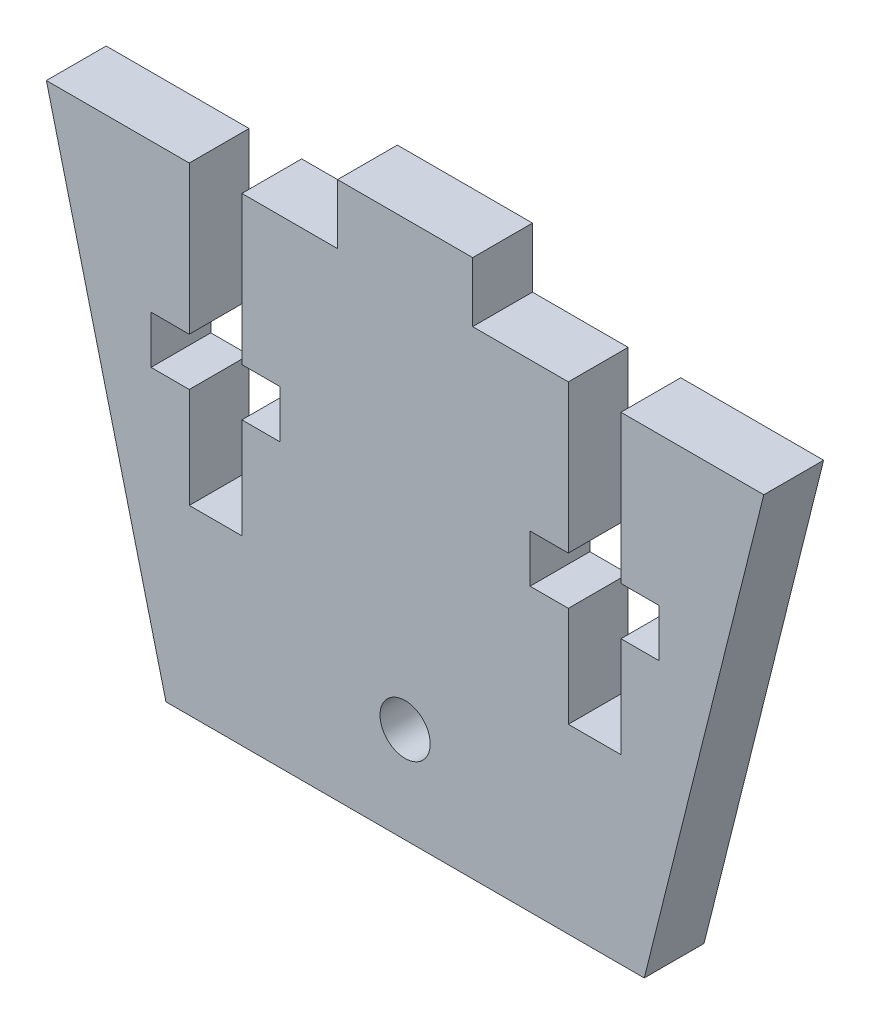
ISO-10303-21;
HEADER;
FILE_DESCRIPTION(('STEP AP214'),'2;1');
FILE_NAME('part.step','',(''),(''),'','','');
FILE_SCHEMA(('AUTOMOTIVE_DESIGN { 1 0 10303 214 1 1 1 1 }'));
ENDSEC;
DATA;
#1=APPLICATION_CONTEXT('core data for automotive mechanical design processes');
#2=APPLICATION_PROTOCOL_DEFINITION('international standard','automotive_design',2000,#1);
#3=PRODUCT_CONTEXT('',#1,'mechanical');
#4=PRODUCT('Part','Part','',(#3));
#5=PRODUCT_RELATED_PRODUCT_CATEGORY('part','',(#4));
#6=PRODUCT_DEFINITION_FORMATION('','',#4);
#7=PRODUCT_DEFINITION_CONTEXT('part definition',#1,'design');
#8=PRODUCT_DEFINITION('design','',#6,#7);
#9=PRODUCT_DEFINITION_SHAPE('','',#8);
#10=(LENGTH_UNIT() NAMED_UNIT(*) SI_UNIT(.MILLI.,.METRE.));
#11=(NAMED_UNIT(*) PLANE_ANGLE_UNIT() SI_UNIT($,.RADIAN.));
#12=(NAMED_UNIT(*) SI_UNIT($,.STERADIAN.) SOLID_ANGLE_UNIT());
#13=UNCERTAINTY_MEASURE_WITH_UNIT(LENGTH_MEASURE(1.E-05),#10,'distance_accuracy_value','');
#14=(GEOMETRIC_REPRESENTATION_CONTEXT(3) GLOBAL_UNCERTAINTY_ASSIGNED_CONTEXT((#13)) GLOBAL_UNIT_ASSIGNED_CONTEXT((#10,
#11,#12)) REPRESENTATION_CONTEXT('',''));
#15=CARTESIAN_POINT('',(0.,0.,0.));
#16=DIRECTION('',(0.,0.,1.));
#17=DIRECTION('',(1.,0.,0.));
#18=AXIS2_PLACEMENT_3D('',#15,#16,#17);
#19=CARTESIAN_POINT('',(0.,28.575,3.175));
#20=DIRECTION('',(0.,1.,0.));
#21=DIRECTION('',(0.,0.,1.));
#22=AXIS2_PLACEMENT_3D('',#19,#20,#21);
#23=PLANE('',#22);
#24=DIRECTION('',(1.,0.,0.));
#25=VECTOR('',#24,1.);
#26=CARTESIAN_POINT('',(0.,28.575,0.));
#27=LINE('',#26,#25);
#28=CARTESIAN_POINT('',(-3.58775,28.575,0.));
#29=VERTEX_POINT('',#28);
#30=CARTESIAN_POINT('',(3.58775,28.575,0.));
#31=VERTEX_POINT('',#30);
#32=EDGE_CURVE('E410',#29,#31,#27,.T.);
#33=ORIENTED_EDGE('',*,*,#32,.F.);
#34=DIRECTION('',(0.,0.,-1.));
#35=VECTOR('',#34,1.);
#36=CARTESIAN_POINT('',(-3.58775,28.575,3.175));
#37=LINE('',#36,#35);
#38=CARTESIAN_POINT('',(-3.58775,28.575,3.175));
#39=VERTEX_POINT('',#38);
#40=EDGE_CURVE('E11',#39,#29,#37,.T.);
#41=ORIENTED_EDGE('',*,*,#40,.F.);
#42=DIRECTION('',(1.,0.,0.));
#43=VECTOR('',#42,1.);
#44=CARTESIAN_POINT('',(0.,28.575,3.175));
#45=LINE('',#44,#43);
#46=CARTESIAN_POINT('',(3.58775,28.575,3.175));
#47=VERTEX_POINT('',#46);
#48=EDGE_CURVE('E325',#39,#47,#45,.T.);
#49=ORIENTED_EDGE('',*,*,#48,.T.);
#50=DIRECTION('',(0.,0.,-1.));
#51=VECTOR('',#50,1.);
#52=CARTESIAN_POINT('',(3.58775,28.575,3.175));
#53=LINE('',#52,#51);
#54=EDGE_CURVE('E161',#47,#31,#53,.T.);
#55=ORIENTED_EDGE('',*,*,#54,.T.);
#56=EDGE_LOOP('',(#33,#41,#49,#55));
#57=FACE_BOUND('',#56,.T.);
#58=ADVANCED_FACE('F39',(#57),#23,.T.);
#59=CARTESIAN_POINT('',(-3.58775,0.,3.175));
#60=DIRECTION('',(-1.,0.,0.));
#61=DIRECTION('',(0.,0.,1.));
#62=AXIS2_PLACEMENT_3D('',#59,#60,#61);
#63=PLANE('',#62);
#64=DIRECTION('',(0.,1.,0.));
#65=VECTOR('',#64,1.);
#66=CARTESIAN_POINT('',(-3.58775,0.,0.));
#67=LINE('',#66,#65);
#68=CARTESIAN_POINT('',(-3.58775,25.4,0.));
#69=VERTEX_POINT('',#68);
#70=EDGE_CURVE('E406',#69,#29,#67,.T.);
#71=ORIENTED_EDGE('',*,*,#70,.F.);
#72=DIRECTION('',(0.,0.,-1.));
#73=VECTOR('',#72,1.);
#74=CARTESIAN_POINT('',(-3.58775,25.4,3.175));
#75=LINE('',#74,#73);
#76=CARTESIAN_POINT('',(-3.58775,25.4,3.175));
#77=VERTEX_POINT('',#76);
#78=EDGE_CURVE('E47',#77,#69,#75,.T.);
#79=ORIENTED_EDGE('',*,*,#78,.F.);
#80=DIRECTION('',(0.,1.,0.));
#81=VECTOR('',#80,1.);
#82=CARTESIAN_POINT('',(-3.58775,0.,3.175));
#83=LINE('',#82,#81);
#84=EDGE_CURVE('E322',#77,#39,#83,.T.);
#85=ORIENTED_EDGE('',*,*,#84,.T.);
#86=ORIENTED_EDGE('',*,*,#40,.T.);
#87=EDGE_LOOP('',(#71,#79,#85,#86));
#88=FACE_BOUND('',#87,.T.);
#89=ADVANCED_FACE('F407',(#88),#63,.T.);
#90=CARTESIAN_POINT('',(0.,25.4,3.175));
#91=DIRECTION('',(0.,1.,0.));
#92=DIRECTION('',(0.,0.,1.));
#93=AXIS2_PLACEMENT_3D('',#90,#91,#92);
#94=PLANE('',#93);
#95=DIRECTION('',(1.,0.,0.));
#96=VECTOR('',#95,1.);
#97=CARTESIAN_POINT('',(0.,25.4,0.));
#98=LINE('',#97,#96);
#99=CARTESIAN_POINT('',(-8.66775,25.4,0.));
#100=VERTEX_POINT('',#99);
#101=EDGE_CURVE('E401',#100,#69,#98,.T.);
#102=ORIENTED_EDGE('',*,*,#101,.F.);
#103=DIRECTION('',(0.,0.,-1.));
#104=VECTOR('',#103,1.);
#105=CARTESIAN_POINT('',(-8.66775,25.4,3.175));
#106=LINE('',#105,#104);
#107=CARTESIAN_POINT('',(-8.66775,25.4,3.175));
#108=VERTEX_POINT('',#107);
#109=EDGE_CURVE('E395',#108,#100,#106,.T.);
#110=ORIENTED_EDGE('',*,*,#109,.F.);
#111=DIRECTION('',(1.,0.,0.));
#112=VECTOR('',#111,1.);
#113=CARTESIAN_POINT('',(0.,25.4,3.175));
#114=LINE('',#113,#112);
#115=EDGE_CURVE('E319',#108,#77,#114,.T.);
#116=ORIENTED_EDGE('',*,*,#115,.T.);
#117=ORIENTED_EDGE('',*,*,#78,.T.);
#118=EDGE_LOOP('',(#102,#110,#116,#117));
#119=FACE_BOUND('',#118,.T.);
#120=ADVANCED_FACE('F399',(#119),#94,.T.);
#121=CARTESIAN_POINT('',(-8.66775,0.,3.175));
#122=DIRECTION('',(1.,0.,0.));
#123=DIRECTION('',(0.,1.,0.));
#124=AXIS2_PLACEMENT_3D('',#121,#122,#123);
#125=PLANE('',#124);
#126=DIRECTION('',(0.,-1.,0.));
#127=VECTOR('',#126,1.);
#128=CARTESIAN_POINT('',(-8.66775,0.,0.));
#129=LINE('',#128,#127);
#130=CARTESIAN_POINT('',(-8.66775,17.526,0.));
#131=VERTEX_POINT('',#130);
#132=EDGE_CURVE('E415',#100,#131,#129,.T.);
#133=ORIENTED_EDGE('',*,*,#132,.T.);
#134=DIRECTION('',(0.,0.,-1.));
#135=VECTOR('',#134,1.);
#136=CARTESIAN_POINT('',(-8.66775,17.526,3.175));
#137=LINE('',#136,#135);
#138=CARTESIAN_POINT('',(-8.66775,17.526,3.175));
#139=VERTEX_POINT('',#138);
#140=EDGE_CURVE('E392',#139,#131,#137,.T.);
#141=ORIENTED_EDGE('',*,*,#140,.F.);
#142=DIRECTION('',(0.,-1.,0.));
#143=VECTOR('',#142,1.);
#144=CARTESIAN_POINT('',(-8.66775,0.,3.175));
#145=LINE('',#144,#143);
#146=EDGE_CURVE('E317',#108,#139,#145,.T.);
#147=ORIENTED_EDGE('',*,*,#146,.F.);
#148=ORIENTED_EDGE('',*,*,#109,.T.);
#149=EDGE_LOOP('',(#133,#141,#147,#148));
#150=FACE_BOUND('',#149,.T.);
#151=ADVANCED_FACE('F587',(#150),#125,.F.);
#152=CARTESIAN_POINT('',(0.,17.526,3.175));
#153=DIRECTION('',(0.,1.,0.));
#154=DIRECTION('',(0.,0.,1.));
#155=AXIS2_PLACEMENT_3D('',#152,#153,#154);
#156=PLANE('',#155);
#157=DIRECTION('',(1.,0.,0.));
#158=VECTOR('',#157,1.);
#159=CARTESIAN_POINT('',(0.,17.526,0.));
#160=LINE('',#159,#158);
#161=CARTESIAN_POINT('',(-6.63575,17.526,0.));
#162=VERTEX_POINT('',#161);
#163=EDGE_CURVE('E417',#131,#162,#160,.T.);
#164=ORIENTED_EDGE('',*,*,#163,.T.);
#165=DIRECTION('',(0.,0.,-1.));
#166=VECTOR('',#165,1.);
#167=CARTESIAN_POINT('',(-6.63575,17.526,3.175));
#168=LINE('',#167,#166);
#169=CARTESIAN_POINT('',(-6.63575,17.526,3.175));
#170=VERTEX_POINT('',#169);
#171=EDGE_CURVE('E389',#170,#162,#168,.T.);
#172=ORIENTED_EDGE('',*,*,#171,.F.);
#173=DIRECTION('',(1.,0.,0.));
#174=VECTOR('',#173,1.);
#175=CARTESIAN_POINT('',(0.,17.526,3.175));
#176=LINE('',#175,#174);
#177=EDGE_CURVE('E315',#139,#170,#176,.T.);
#178=ORIENTED_EDGE('',*,*,#177,.F.);
#179=ORIENTED_EDGE('',*,*,#140,.T.);
#180=EDGE_LOOP('',(#164,#172,#178,#179));
#181=FACE_BOUND('',#180,.T.);
#182=ADVANCED_FACE('F582',(#181),#156,.F.);
#183=CARTESIAN_POINT('',(-6.63574999999997,0.,3.175));
#184=DIRECTION('',(1.,0.,0.));
#185=DIRECTION('',(0.,1.,0.));
#186=AXIS2_PLACEMENT_3D('',#183,#184,#185);
#187=PLANE('',#186);
#188=DIRECTION('',(0.,-1.,0.));
#189=VECTOR('',#188,1.);
#190=CARTESIAN_POINT('',(-6.63574999999997,0.,0.));
#191=LINE('',#190,#189);
#192=CARTESIAN_POINT('',(-6.63575,14.986,0.));
#193=VERTEX_POINT('',#192);
#194=EDGE_CURVE('E423',#162,#193,#191,.T.);
#195=ORIENTED_EDGE('',*,*,#194,.T.);
#196=DIRECTION('',(0.,0.,-1.));
#197=VECTOR('',#196,1.);
#198=CARTESIAN_POINT('',(-6.63575,14.986,3.175));
#199=LINE('',#198,#197);
#200=CARTESIAN_POINT('',(-6.63575,14.986,3.175));
#201=VERTEX_POINT('',#200);
#202=EDGE_CURVE('E386',#201,#193,#199,.T.);
#203=ORIENTED_EDGE('',*,*,#202,.F.);
#204=DIRECTION('',(0.,-1.,0.));
#205=VECTOR('',#204,1.);
#206=CARTESIAN_POINT('',(-6.63574999999997,0.,3.175));
#207=LINE('',#206,#205);
#208=EDGE_CURVE('E313',#170,#201,#207,.T.);
#209=ORIENTED_EDGE('',*,*,#208,.F.);
#210=ORIENTED_EDGE('',*,*,#171,.T.);
#211=EDGE_LOOP('',(#195,#203,#209,#210));
#212=FACE_BOUND('',#211,.T.);
#213=ADVANCED_FACE('F579',(#212),#187,.F.);
#214=CARTESIAN_POINT('',(0.,14.986,3.175));
#215=DIRECTION('',(0.,-1.,0.));
#216=DIRECTION('',(0.,0.,-1.));
#217=AXIS2_PLACEMENT_3D('',#214,#215,#216);
#218=PLANE('',#217);
#219=DIRECTION('',(-1.,0.,0.));
#220=VECTOR('',#219,1.);
#221=CARTESIAN_POINT('',(0.,14.986,0.));
#222=LINE('',#221,#220);
#223=CARTESIAN_POINT('',(-8.66775,14.986,0.));
#224=VERTEX_POINT('',#223);
#225=EDGE_CURVE('E426',#193,#224,#222,.T.);
#226=ORIENTED_EDGE('',*,*,#225,.T.);
#227=DIRECTION('',(0.,0.,-1.));
#228=VECTOR('',#227,1.);
#229=CARTESIAN_POINT('',(-8.66775,14.986,3.175));
#230=LINE('',#229,#228);
#231=CARTESIAN_POINT('',(-8.66775,14.986,3.175));
#232=VERTEX_POINT('',#231);
#233=EDGE_CURVE('E383',#232,#224,#230,.T.);
#234=ORIENTED_EDGE('',*,*,#233,.F.);
#235=DIRECTION('',(-1.,0.,0.));
#236=VECTOR('',#235,1.);
#237=CARTESIAN_POINT('',(0.,14.986,3.175));
#238=LINE('',#237,#236);
#239=EDGE_CURVE('E311',#201,#232,#238,.T.);
#240=ORIENTED_EDGE('',*,*,#239,.F.);
#241=ORIENTED_EDGE('',*,*,#202,.T.);
#242=EDGE_LOOP('',(#226,#234,#240,#241));
#243=FACE_BOUND('',#242,.T.);
#244=ADVANCED_FACE('F575',(#243),#218,.F.);
#245=CARTESIAN_POINT('',(-8.66775,9.65199999999999,0.));
#246=VERTEX_POINT('',#245);
#247=EDGE_CURVE('E419',#224,#246,#129,.T.);
#248=ORIENTED_EDGE('',*,*,#247,.T.);
#249=DIRECTION('',(0.,0.,-1.));
#250=VECTOR('',#249,1.);
#251=CARTESIAN_POINT('',(-8.66775,9.65199999999999,3.175));
#252=LINE('',#251,#250);
#253=CARTESIAN_POINT('',(-8.66775,9.65199999999999,3.175));
#254=VERTEX_POINT('',#253);
#255=EDGE_CURVE('E381',#254,#246,#252,.T.);
#256=ORIENTED_EDGE('',*,*,#255,.F.);
#257=EDGE_CURVE('E310',#232,#254,#145,.T.);
#258=ORIENTED_EDGE('',*,*,#257,.F.);
#259=ORIENTED_EDGE('',*,*,#233,.T.);
#260=EDGE_LOOP('',(#248,#256,#258,#259));
#261=FACE_BOUND('',#260,.T.);
#262=ADVANCED_FACE('F570',(#261),#125,.F.);
#263=CARTESIAN_POINT('',(0.,9.65199999999999,3.175));
#264=DIRECTION('',(0.,1.,0.));
#265=DIRECTION('',(0.,0.,1.));
#266=AXIS2_PLACEMENT_3D('',#263,#264,#265);
#267=PLANE('',#266);
#268=DIRECTION('',(1.,0.,0.));
#269=VECTOR('',#268,1.);
#270=CARTESIAN_POINT('',(0.,9.65199999999999,0.));
#271=LINE('',#270,#269);
#272=CARTESIAN_POINT('',(-11.46175,9.65199999999999,0.));
#273=VERTEX_POINT('',#272);
#274=EDGE_CURVE('E429',#273,#246,#271,.T.);
#275=ORIENTED_EDGE('',*,*,#274,.F.);
#276=DIRECTION('',(0.,0.,-1.));
#277=VECTOR('',#276,1.);
#278=CARTESIAN_POINT('',(-11.46175,9.65199999999999,3.175));
#279=LINE('',#278,#277);
#280=CARTESIAN_POINT('',(-11.46175,9.65199999999999,3.175));
#281=VERTEX_POINT('',#280);
#282=EDGE_CURVE('E379',#281,#273,#279,.T.);
#283=ORIENTED_EDGE('',*,*,#282,.F.);
#284=DIRECTION('',(1.,0.,0.));
#285=VECTOR('',#284,1.);
#286=CARTESIAN_POINT('',(0.,9.65199999999999,3.175));
#287=LINE('',#286,#285);
#288=EDGE_CURVE('E307',#281,#254,#287,.T.);
#289=ORIENTED_EDGE('',*,*,#288,.T.);
#290=ORIENTED_EDGE('',*,*,#255,.T.);
#291=EDGE_LOOP('',(#275,#283,#289,#290));
#292=FACE_BOUND('',#291,.T.);
#293=ADVANCED_FACE('F563',(#292),#267,.T.);
#294=CARTESIAN_POINT('',(-11.46175,0.,3.175));
#295=DIRECTION('',(1.,0.,0.));
#296=DIRECTION('',(0.,1.,0.));
#297=AXIS2_PLACEMENT_3D('',#294,#295,#296);
#298=PLANE('',#297);
#299=DIRECTION('',(0.,-1.,0.));
#300=VECTOR('',#299,1.);
#301=CARTESIAN_POINT('',(-11.46175,0.,0.));
#302=LINE('',#301,#300);
#303=CARTESIAN_POINT('',(-11.46175,14.986,0.));
#304=VERTEX_POINT('',#303);
#305=EDGE_CURVE('E432',#304,#273,#302,.T.);
#306=ORIENTED_EDGE('',*,*,#305,.F.);
#307=DIRECTION('',(0.,0.,-1.));
#308=VECTOR('',#307,1.);
#309=CARTESIAN_POINT('',(-11.46175,14.986,3.175));
#310=LINE('',#309,#308);
#311=CARTESIAN_POINT('',(-11.46175,14.986,3.175));
#312=VERTEX_POINT('',#311);
#313=EDGE_CURVE('E377',#312,#304,#310,.T.);
#314=ORIENTED_EDGE('',*,*,#313,.F.);
#315=DIRECTION('',(0.,-1.,0.));
#316=VECTOR('',#315,1.);
#317=CARTESIAN_POINT('',(-11.46175,0.,3.175));
#318=LINE('',#317,#316);
#319=EDGE_CURVE('E304',#312,#281,#318,.T.);
#320=ORIENTED_EDGE('',*,*,#319,.T.);
#321=ORIENTED_EDGE('',*,*,#282,.T.);
#322=EDGE_LOOP('',(#306,#314,#320,#321));
#323=FACE_BOUND('',#322,.T.);
#324=ADVANCED_FACE('F557',(#323),#298,.T.);
#325=CARTESIAN_POINT('',(-13.49375,14.986,0.));
#326=VERTEX_POINT('',#325);
#327=EDGE_CURVE('E428',#304,#326,#222,.T.);
#328=ORIENTED_EDGE('',*,*,#327,.T.);
#329=DIRECTION('',(0.,0.,-1.));
#330=VECTOR('',#329,1.);
#331=CARTESIAN_POINT('',(-13.49375,14.986,3.175));
#332=LINE('',#331,#330);
#333=CARTESIAN_POINT('',(-13.49375,14.986,3.175));
#334=VERTEX_POINT('',#333);
#335=EDGE_CURVE('E375',#334,#326,#332,.T.);
#336=ORIENTED_EDGE('',*,*,#335,.F.);
#337=EDGE_CURVE('E303',#312,#334,#238,.T.);
#338=ORIENTED_EDGE('',*,*,#337,.F.);
#339=ORIENTED_EDGE('',*,*,#313,.T.);
#340=EDGE_LOOP('',(#328,#336,#338,#339));
#341=FACE_BOUND('',#340,.T.);
#342=ADVANCED_FACE('F588',(#341),#218,.F.);
#343=CARTESIAN_POINT('',(-13.49375,0.,3.175));
#344=DIRECTION('',(1.,0.,0.));
#345=DIRECTION('',(0.,1.,0.));
#346=AXIS2_PLACEMENT_3D('',#343,#344,#345);
#347=PLANE('',#346);
#348=DIRECTION('',(0.,-1.,0.));
#349=VECTOR('',#348,1.);
#350=CARTESIAN_POINT('',(-13.49375,0.,0.));
#351=LINE('',#350,#349);
#352=CARTESIAN_POINT('',(-13.49375,17.526,0.));
#353=VERTEX_POINT('',#352);
#354=EDGE_CURVE('E436',#353,#326,#351,.T.);
#355=ORIENTED_EDGE('',*,*,#354,.F.);
#356=DIRECTION('',(0.,0.,-1.));
#357=VECTOR('',#356,1.);
#358=CARTESIAN_POINT('',(-13.49375,17.526,3.175));
#359=LINE('',#358,#357);
#360=CARTESIAN_POINT('',(-13.49375,17.526,3.175));
#361=VERTEX_POINT('',#360);
#362=EDGE_CURVE('E373',#361,#353,#359,.T.);
#363=ORIENTED_EDGE('',*,*,#362,.F.);
#364=DIRECTION('',(0.,-1.,0.));
#365=VECTOR('',#364,1.);
#366=CARTESIAN_POINT('',(-13.49375,0.,3.175));
#367=LINE('',#366,#365);
#368=EDGE_CURVE('E299',#361,#334,#367,.T.);
#369=ORIENTED_EDGE('',*,*,#368,.T.);
#370=ORIENTED_EDGE('',*,*,#335,.T.);
#371=EDGE_LOOP('',(#355,#363,#369,#370));
#372=FACE_BOUND('',#371,.T.);
#373=ADVANCED_FACE('F550',(#372),#347,.T.);
#374=CARTESIAN_POINT('',(-11.46175,17.526,0.));
#375=VERTEX_POINT('',#374);
#376=EDGE_CURVE('E424',#353,#375,#160,.T.);
#377=ORIENTED_EDGE('',*,*,#376,.T.);
#378=DIRECTION('',(0.,0.,-1.));
#379=VECTOR('',#378,1.);
#380=CARTESIAN_POINT('',(-11.46175,17.526,3.175));
#381=LINE('',#380,#379);
#382=CARTESIAN_POINT('',(-11.46175,17.526,3.175));
#383=VERTEX_POINT('',#382);
#384=EDGE_CURVE('E371',#383,#375,#381,.T.);
#385=ORIENTED_EDGE('',*,*,#384,.F.);
#386=EDGE_CURVE('E302',#361,#383,#176,.T.);
#387=ORIENTED_EDGE('',*,*,#386,.F.);
#388=ORIENTED_EDGE('',*,*,#362,.T.);
#389=EDGE_LOOP('',(#377,#385,#387,#388));
#390=FACE_BOUND('',#389,.T.);
#391=ADVANCED_FACE('F545',(#390),#156,.F.);
#392=CARTESIAN_POINT('',(-11.46175,25.4,0.));
#393=VERTEX_POINT('',#392);
#394=EDGE_CURVE('E435',#393,#375,#302,.T.);
#395=ORIENTED_EDGE('',*,*,#394,.F.);
#396=DIRECTION('',(0.,0.,-1.));
#397=VECTOR('',#396,1.);
#398=CARTESIAN_POINT('',(-11.46175,25.4,3.175));
#399=LINE('',#398,#397);
#400=CARTESIAN_POINT('',(-11.46175,25.4,3.175));
#401=VERTEX_POINT('',#400);
#402=EDGE_CURVE('E369',#401,#393,#399,.T.);
#403=ORIENTED_EDGE('',*,*,#402,.F.);
#404=EDGE_CURVE('E298',#401,#383,#318,.T.);
#405=ORIENTED_EDGE('',*,*,#404,.T.);
#406=ORIENTED_EDGE('',*,*,#384,.T.);
#407=EDGE_LOOP('',(#395,#403,#405,#406));
#408=FACE_BOUND('',#407,.T.);
#409=ADVANCED_FACE('F597',(#408),#298,.T.);
#410=CARTESIAN_POINT('',(0.,25.4,3.175));
#411=DIRECTION('',(0.,1.,0.));
#412=DIRECTION('',(-1.,0.,0.));
#413=AXIS2_PLACEMENT_3D('',#410,#411,#412);
#414=PLANE('',#413);
#415=DIRECTION('',(1.,0.,0.));
#416=VECTOR('',#415,1.);
#417=CARTESIAN_POINT('',(0.,25.4,0.));
#418=LINE('',#417,#416);
#419=CARTESIAN_POINT('',(-19.05,25.4,0.));
#420=VERTEX_POINT('',#419);
#421=EDGE_CURVE('E439',#420,#393,#418,.T.);
#422=ORIENTED_EDGE('',*,*,#421,.F.);
#423=DIRECTION('',(0.,0.,-1.));
#424=VECTOR('',#423,1.);
#425=CARTESIAN_POINT('',(-19.05,25.4,3.175));
#426=LINE('',#425,#424);
#427=CARTESIAN_POINT('',(-19.05,25.4,3.175));
#428=VERTEX_POINT('',#427);
#429=EDGE_CURVE('E367',#428,#420,#426,.T.);
#430=ORIENTED_EDGE('',*,*,#429,.F.);
#431=DIRECTION('',(1.,0.,0.));
#432=VECTOR('',#431,1.);
#433=CARTESIAN_POINT('',(0.,25.4,3.175));
#434=LINE('',#433,#432);
#435=EDGE_CURVE('E295',#428,#401,#434,.T.);
#436=ORIENTED_EDGE('',*,*,#435,.T.);
#437=ORIENTED_EDGE('',*,*,#402,.T.);
#438=EDGE_LOOP('',(#422,#430,#436,#437));
#439=FACE_BOUND('',#438,.T.);
#440=ADVANCED_FACE('F536',(#439),#414,.T.);
#441=CARTESIAN_POINT('',(-11.9529411764706,-2.98823529411765,3.175));
#442=DIRECTION('',(0.970142500145332,0.242535625036333,0.));
#443=DIRECTION('',(-0.242535625036333,0.970142500145332,0.));
#444=AXIS2_PLACEMENT_3D('',#441,#442,#443);
#445=PLANE('',#444);
#446=DIRECTION('',(0.242535625036333,-0.970142500145332,0.));
#447=VECTOR('',#446,1.);
#448=CARTESIAN_POINT('',(-11.9529411764706,-2.98823529411765,0.));
#449=LINE('',#448,#447);
#450=CARTESIAN_POINT('',(-12.7,0.,0.));
#451=VERTEX_POINT('',#450);
#452=EDGE_CURVE('E442',#420,#451,#449,.T.);
#453=ORIENTED_EDGE('',*,*,#452,.T.);
#454=DIRECTION('',(0.,0.,-1.));
#455=VECTOR('',#454,1.);
#456=CARTESIAN_POINT('',(-12.7,0.,3.175));
#457=LINE('',#456,#455);
#458=CARTESIAN_POINT('',(-12.7,0.,3.175));
#459=VERTEX_POINT('',#458);
#460=EDGE_CURVE('E364',#459,#451,#457,.T.);
#461=ORIENTED_EDGE('',*,*,#460,.F.);
#462=DIRECTION('',(0.242535625036333,-0.970142500145332,0.));
#463=VECTOR('',#462,1.);
#464=CARTESIAN_POINT('',(-11.9529411764706,-2.98823529411765,3.175));
#465=LINE('',#464,#463);
#466=EDGE_CURVE('E291',#428,#459,#465,.T.);
#467=ORIENTED_EDGE('',*,*,#466,.F.);
#468=ORIENTED_EDGE('',*,*,#429,.T.);
#469=EDGE_LOOP('',(#453,#461,#467,#468));
#470=FACE_BOUND('',#469,.T.);
#471=ADVANCED_FACE('F533',(#470),#445,.F.);
#472=CARTESIAN_POINT('',(0.,0.,3.175));
#473=DIRECTION('',(0.,1.,0.));
#474=DIRECTION('',(-1.,0.,0.));
#475=AXIS2_PLACEMENT_3D('',#472,#473,#474);
#476=PLANE('',#475);
#477=DIRECTION('',(1.,0.,0.));
#478=VECTOR('',#477,1.);
#479=CARTESIAN_POINT('',(0.,0.,0.));
#480=LINE('',#479,#478);
#481=CARTESIAN_POINT('',(12.7,0.,0.));
#482=VERTEX_POINT('',#481);
#483=EDGE_CURVE('E444',#451,#482,#480,.T.);
#484=ORIENTED_EDGE('',*,*,#483,.T.);
#485=DIRECTION('',(0.,0.,-1.));
#486=VECTOR('',#485,1.);
#487=CARTESIAN_POINT('',(12.7,0.,3.175));
#488=LINE('',#487,#486);
#489=CARTESIAN_POINT('',(12.7,0.,3.175));
#490=VERTEX_POINT('',#489);
#491=EDGE_CURVE('E362',#490,#482,#488,.T.);
#492=ORIENTED_EDGE('',*,*,#491,.F.);
#493=DIRECTION('',(1.,0.,0.));
#494=VECTOR('',#493,1.);
#495=CARTESIAN_POINT('',(0.,0.,3.175));
#496=LINE('',#495,#494);
#497=EDGE_CURVE('E288',#459,#490,#496,.T.);
#498=ORIENTED_EDGE('',*,*,#497,.F.);
#499=ORIENTED_EDGE('',*,*,#460,.T.);
#500=EDGE_LOOP('',(#484,#492,#498,#499));
#501=FACE_BOUND('',#500,.T.);
#502=ADVANCED_FACE('F528',(#501),#476,.F.);
#503=CARTESIAN_POINT('',(11.9529411764706,-2.98823529411765,3.175));
#504=DIRECTION('',(0.970142500145332,-0.242535625036333,0.));
#505=DIRECTION('',(0.242535625036333,0.970142500145332,0.));
#506=AXIS2_PLACEMENT_3D('',#503,#504,#505);
#507=PLANE('',#506);
#508=DIRECTION('',(-0.242535625036333,-0.970142500145332,0.));
#509=VECTOR('',#508,1.);
#510=CARTESIAN_POINT('',(11.9529411764706,-2.98823529411765,0.));
#511=LINE('',#510,#509);
#512=CARTESIAN_POINT('',(19.05,25.4,0.));
#513=VERTEX_POINT('',#512);
#514=EDGE_CURVE('E447',#513,#482,#511,.T.);
#515=ORIENTED_EDGE('',*,*,#514,.F.);
#516=DIRECTION('',(0.,0.,-1.));
#517=VECTOR('',#516,1.);
#518=CARTESIAN_POINT('',(19.05,25.4,3.175));
#519=LINE('',#518,#517);
#520=CARTESIAN_POINT('',(19.05,25.4,3.175));
#521=VERTEX_POINT('',#520);
#522=EDGE_CURVE('E360',#521,#513,#519,.T.);
#523=ORIENTED_EDGE('',*,*,#522,.F.);
#524=DIRECTION('',(-0.242535625036333,-0.970142500145332,0.));
#525=VECTOR('',#524,1.);
#526=CARTESIAN_POINT('',(11.9529411764706,-2.98823529411765,3.175));
#527=LINE('',#526,#525);
#528=EDGE_CURVE('E282',#521,#490,#527,.T.);
#529=ORIENTED_EDGE('',*,*,#528,.T.);
#530=ORIENTED_EDGE('',*,*,#491,.T.);
#531=EDGE_LOOP('',(#515,#523,#529,#530));
#532=FACE_BOUND('',#531,.T.);
#533=ADVANCED_FACE('F522',(#532),#507,.T.);
#534=CARTESIAN_POINT('',(0.,25.4,3.175));
#535=DIRECTION('',(0.,1.,0.));
#536=DIRECTION('',(-1.,0.,0.));
#537=AXIS2_PLACEMENT_3D('',#534,#535,#536);
#538=PLANE('',#537);
#539=DIRECTION('',(1.,0.,0.));
#540=VECTOR('',#539,1.);
#541=CARTESIAN_POINT('',(0.,25.4,0.));
#542=LINE('',#541,#540);
#543=CARTESIAN_POINT('',(11.46175,25.4,0.));
#544=VERTEX_POINT('',#543);
#545=EDGE_CURVE('E450',#544,#513,#542,.T.);
#546=ORIENTED_EDGE('',*,*,#545,.F.);
#547=DIRECTION('',(0.,0.,-1.));
#548=VECTOR('',#547,1.);
#549=CARTESIAN_POINT('',(11.46175,25.4,3.175));
#550=LINE('',#549,#548);
#551=CARTESIAN_POINT('',(11.46175,25.4,3.175));
#552=VERTEX_POINT('',#551);
#553=EDGE_CURVE('E358',#552,#544,#550,.T.);
#554=ORIENTED_EDGE('',*,*,#553,.F.);
#555=DIRECTION('',(1.,0.,0.));
#556=VECTOR('',#555,1.);
#557=CARTESIAN_POINT('',(0.,25.4,3.175));
#558=LINE('',#557,#556);
#559=EDGE_CURVE('E275',#552,#521,#558,.T.);
#560=ORIENTED_EDGE('',*,*,#559,.T.);
#561=ORIENTED_EDGE('',*,*,#522,.T.);
#562=EDGE_LOOP('',(#546,#554,#560,#561));
#563=FACE_BOUND('',#562,.T.);
#564=ADVANCED_FACE('F520',(#563),#538,.T.);
#565=CARTESIAN_POINT('',(11.46175,0.,3.175));
#566=DIRECTION('',(1.,0.,0.));
#567=DIRECTION('',(0.,1.,0.));
#568=AXIS2_PLACEMENT_3D('',#565,#566,#567);
#569=PLANE('',#568);
#570=DIRECTION('',(0.,-1.,0.));
#571=VECTOR('',#570,1.);
#572=CARTESIAN_POINT('',(11.46175,0.,0.));
#573=LINE('',#572,#571);
#574=CARTESIAN_POINT('',(11.46175,17.526,0.));
#575=VERTEX_POINT('',#574);
#576=EDGE_CURVE('E453',#544,#575,#573,.T.);
#577=ORIENTED_EDGE('',*,*,#576,.T.);
#578=DIRECTION('',(0.,0.,-1.));
#579=VECTOR('',#578,1.);
#580=CARTESIAN_POINT('',(11.46175,17.526,3.175));
#581=LINE('',#580,#579);
#582=CARTESIAN_POINT('',(11.46175,17.526,3.175));
#583=VERTEX_POINT('',#582);
#584=EDGE_CURVE('E356',#583,#575,#581,.T.);
#585=ORIENTED_EDGE('',*,*,#584,.F.);
#586=DIRECTION('',(0.,-1.,0.));
#587=VECTOR('',#586,1.);
#588=CARTESIAN_POINT('',(11.46175,0.,3.175));
#589=LINE('',#588,#587);
#590=EDGE_CURVE('E281',#552,#583,#589,.T.);
#591=ORIENTED_EDGE('',*,*,#590,.F.);
#592=ORIENTED_EDGE('',*,*,#553,.T.);
#593=EDGE_LOOP('',(#577,#585,#591,#592));
#594=FACE_BOUND('',#593,.T.);
#595=ADVANCED_FACE('F518',(#594),#569,.F.);
#596=CARTESIAN_POINT('',(0.,17.526,3.175));
#597=DIRECTION('',(0.,-1.,0.));
#598=DIRECTION('',(0.,0.,-1.));
#599=AXIS2_PLACEMENT_3D('',#596,#597,#598);
#600=PLANE('',#599);
#601=DIRECTION('',(-1.,0.,0.));
#602=VECTOR('',#601,1.);
#603=CARTESIAN_POINT('',(0.,17.526,0.));
#604=LINE('',#603,#602);
#605=CARTESIAN_POINT('',(13.49375,17.526,0.));
#606=VERTEX_POINT('',#605);
#607=EDGE_CURVE('E456',#606,#575,#604,.T.);
#608=ORIENTED_EDGE('',*,*,#607,.F.);
#609=DIRECTION('',(0.,0.,-1.));
#610=VECTOR('',#609,1.);
#611=CARTESIAN_POINT('',(13.49375,17.526,3.175));
#612=LINE('',#611,#610);
#613=CARTESIAN_POINT('',(13.49375,17.526,3.175));
#614=VERTEX_POINT('',#613);
#615=EDGE_CURVE('E354',#614,#606,#612,.T.);
#616=ORIENTED_EDGE('',*,*,#615,.F.);
#617=DIRECTION('',(-1.,0.,0.));
#618=VECTOR('',#617,1.);
#619=CARTESIAN_POINT('',(0.,17.526,3.175));
#620=LINE('',#619,#618);
#621=EDGE_CURVE('E285',#614,#583,#620,.T.);
#622=ORIENTED_EDGE('',*,*,#621,.T.);
#623=ORIENTED_EDGE('',*,*,#584,.T.);
#624=EDGE_LOOP('',(#608,#616,#622,#623));
#625=FACE_BOUND('',#624,.T.);
#626=ADVANCED_FACE('F512',(#625),#600,.T.);
#627=CARTESIAN_POINT('',(13.49375,0.,3.175));
#628=DIRECTION('',(1.,0.,0.));
#629=DIRECTION('',(0.,1.,0.));
#630=AXIS2_PLACEMENT_3D('',#627,#628,#629);
#631=PLANE('',#630);
#632=DIRECTION('',(0.,-1.,0.));
#633=VECTOR('',#632,1.);
#634=CARTESIAN_POINT('',(13.49375,0.,0.));
#635=LINE('',#634,#633);
#636=CARTESIAN_POINT('',(13.49375,14.986,0.));
#637=VERTEX_POINT('',#636);
#638=EDGE_CURVE('E460',#606,#637,#635,.T.);
#639=ORIENTED_EDGE('',*,*,#638,.T.);
#640=DIRECTION('',(0.,0.,-1.));
#641=VECTOR('',#640,1.);
#642=CARTESIAN_POINT('',(13.49375,14.986,3.175));
#643=LINE('',#642,#641);
#644=CARTESIAN_POINT('',(13.49375,14.986,3.175));
#645=VERTEX_POINT('',#644);
#646=EDGE_CURVE('E352',#645,#637,#643,.T.);
#647=ORIENTED_EDGE('',*,*,#646,.F.);
#648=DIRECTION('',(0.,-1.,0.));
#649=VECTOR('',#648,1.);
#650=CARTESIAN_POINT('',(13.49375,0.,3.175));
#651=LINE('',#650,#649);
#652=EDGE_CURVE('E613',#614,#645,#651,.T.);
#653=ORIENTED_EDGE('',*,*,#652,.F.);
#654=ORIENTED_EDGE('',*,*,#615,.T.);
#655=EDGE_LOOP('',(#639,#647,#653,#654));
#656=FACE_BOUND('',#655,.T.);
#657=ADVANCED_FACE('F508',(#656),#631,.F.);
#658=CARTESIAN_POINT('',(0.,14.986,3.175));
#659=DIRECTION('',(0.,1.,0.));
#660=DIRECTION('',(0.,0.,1.));
#661=AXIS2_PLACEMENT_3D('',#658,#659,#660);
#662=PLANE('',#661);
#663=DIRECTION('',(1.,0.,0.));
#664=VECTOR('',#663,1.);
#665=CARTESIAN_POINT('',(0.,14.986,0.));
#666=LINE('',#665,#664);
#667=CARTESIAN_POINT('',(11.46175,14.986,0.));
#668=VERTEX_POINT('',#667);
#669=EDGE_CURVE('E464',#668,#637,#666,.T.);
#670=ORIENTED_EDGE('',*,*,#669,.F.);
#671=DIRECTION('',(0.,0.,-1.));
#672=VECTOR('',#671,1.);
#673=CARTESIAN_POINT('',(11.46175,14.986,3.175));
#674=LINE('',#673,#672);
#675=CARTESIAN_POINT('',(11.46175,14.986,3.175));
#676=VERTEX_POINT('',#675);
#677=EDGE_CURVE('E350',#676,#668,#674,.T.);
#678=ORIENTED_EDGE('',*,*,#677,.F.);
#679=DIRECTION('',(1.,0.,0.));
#680=VECTOR('',#679,1.);
#681=CARTESIAN_POINT('',(0.,14.986,3.175));
#682=LINE('',#681,#680);
#683=EDGE_CURVE('E505',#676,#645,#682,.T.);
#684=ORIENTED_EDGE('',*,*,#683,.T.);
#685=ORIENTED_EDGE('',*,*,#646,.T.);
#686=EDGE_LOOP('',(#670,#678,#684,#685));
#687=FACE_BOUND('',#686,.T.);
#688=ADVANCED_FACE('F500',(#687),#662,.T.);
#689=CARTESIAN_POINT('',(11.46175,9.65199999999999,0.));
#690=VERTEX_POINT('',#689);
#691=EDGE_CURVE('E457',#668,#690,#573,.T.);
#692=ORIENTED_EDGE('',*,*,#691,.T.);
#693=DIRECTION('',(0.,0.,-1.));
#694=VECTOR('',#693,1.);
#695=CARTESIAN_POINT('',(11.46175,9.65199999999999,3.175));
#696=LINE('',#695,#694);
#697=CARTESIAN_POINT('',(11.46175,9.65199999999999,3.175));
#698=VERTEX_POINT('',#697);
#699=EDGE_CURVE('E347',#698,#690,#696,.T.);
#700=ORIENTED_EDGE('',*,*,#699,.F.);
#701=EDGE_CURVE('E286',#676,#698,#589,.T.);
#702=ORIENTED_EDGE('',*,*,#701,.F.);
#703=ORIENTED_EDGE('',*,*,#677,.T.);
#704=EDGE_LOOP('',(#692,#700,#702,#703));
#705=FACE_BOUND('',#704,.T.);
#706=ADVANCED_FACE('F643',(#705),#569,.F.);
#707=CARTESIAN_POINT('',(0.,9.65199999999999,3.175));
#708=DIRECTION('',(0.,-1.,0.));
#709=DIRECTION('',(0.,0.,-1.));
#710=AXIS2_PLACEMENT_3D('',#707,#708,#709);
#711=PLANE('',#710);
#712=DIRECTION('',(-1.,0.,0.));
#713=VECTOR('',#712,1.);
#714=CARTESIAN_POINT('',(0.,9.65199999999999,0.));
#715=LINE('',#714,#713);
#716=CARTESIAN_POINT('',(8.66775,9.65199999999999,0.));
#717=VERTEX_POINT('',#716);
#718=EDGE_CURVE('E468',#690,#717,#715,.T.);
#719=ORIENTED_EDGE('',*,*,#718,.T.);
#720=DIRECTION('',(0.,0.,-1.));
#721=VECTOR('',#720,1.);
#722=CARTESIAN_POINT('',(8.66775,9.65199999999999,3.175));
#723=LINE('',#722,#721);
#724=CARTESIAN_POINT('',(8.66775,9.65199999999999,3.175));
#725=VERTEX_POINT('',#724);
#726=EDGE_CURVE('E345',#725,#717,#723,.T.);
#727=ORIENTED_EDGE('',*,*,#726,.F.);
#728=DIRECTION('',(-1.,0.,0.));
#729=VECTOR('',#728,1.);
#730=CARTESIAN_POINT('',(0.,9.65199999999999,3.175));
#731=LINE('',#730,#729);
#732=EDGE_CURVE('E610',#698,#725,#731,.T.);
#733=ORIENTED_EDGE('',*,*,#732,.F.);
#734=ORIENTED_EDGE('',*,*,#699,.T.);
#735=EDGE_LOOP('',(#719,#727,#733,#734));
#736=FACE_BOUND('',#735,.T.);
#737=ADVANCED_FACE('F493',(#736),#711,.F.);
#738=CARTESIAN_POINT('',(8.66775,0.,3.175));
#739=DIRECTION('',(1.,0.,0.));
#740=DIRECTION('',(0.,1.,0.));
#741=AXIS2_PLACEMENT_3D('',#738,#739,#740);
#742=PLANE('',#741);
#743=DIRECTION('',(0.,-1.,0.));
#744=VECTOR('',#743,1.);
#745=CARTESIAN_POINT('',(8.66775,0.,0.));
#746=LINE('',#745,#744);
#747=CARTESIAN_POINT('',(8.66775,14.986,0.));
#748=VERTEX_POINT('',#747);
#749=EDGE_CURVE('E471',#748,#717,#746,.T.);
#750=ORIENTED_EDGE('',*,*,#749,.F.);
#751=DIRECTION('',(0.,0.,-1.));
#752=VECTOR('',#751,1.);
#753=CARTESIAN_POINT('',(8.66775,14.986,3.175));
#754=LINE('',#753,#752);
#755=CARTESIAN_POINT('',(8.66775,14.986,3.175));
#756=VERTEX_POINT('',#755);
#757=EDGE_CURVE('E343',#756,#748,#754,.T.);
#758=ORIENTED_EDGE('',*,*,#757,.F.);
#759=DIRECTION('',(0.,-1.,0.));
#760=VECTOR('',#759,1.);
#761=CARTESIAN_POINT('',(8.66775,0.,3.175));
#762=LINE('',#761,#760);
#763=EDGE_CURVE('E272',#756,#725,#762,.T.);
#764=ORIENTED_EDGE('',*,*,#763,.T.);
#765=ORIENTED_EDGE('',*,*,#726,.T.);
#766=EDGE_LOOP('',(#750,#758,#764,#765));
#767=FACE_BOUND('',#766,.T.);
#768=ADVANCED_FACE('F489',(#767),#742,.T.);
#769=CARTESIAN_POINT('',(6.63575,14.986,0.));
#770=VERTEX_POINT('',#769);
#771=EDGE_CURVE('E467',#770,#748,#666,.T.);
#772=ORIENTED_EDGE('',*,*,#771,.F.);
#773=DIRECTION('',(0.,0.,-1.));
#774=VECTOR('',#773,1.);
#775=CARTESIAN_POINT('',(6.63575,14.986,3.175));
#776=LINE('',#775,#774);
#777=CARTESIAN_POINT('',(6.63575,14.986,3.175));
#778=VERTEX_POINT('',#777);
#779=EDGE_CURVE('E341',#778,#770,#776,.T.);
#780=ORIENTED_EDGE('',*,*,#779,.F.);
#781=EDGE_CURVE('E485',#778,#756,#682,.T.);
#782=ORIENTED_EDGE('',*,*,#781,.T.);
#783=ORIENTED_EDGE('',*,*,#757,.T.);
#784=EDGE_LOOP('',(#772,#780,#782,#783));
#785=FACE_BOUND('',#784,.T.);
#786=ADVANCED_FACE('F482',(#785),#662,.T.);
#787=CARTESIAN_POINT('',(6.63574999999997,0.,3.175));
#788=DIRECTION('',(1.,0.,0.));
#789=DIRECTION('',(0.,1.,0.));
#790=AXIS2_PLACEMENT_3D('',#787,#788,#789);
#791=PLANE('',#790);
#792=DIRECTION('',(0.,-1.,0.));
#793=VECTOR('',#792,1.);
#794=CARTESIAN_POINT('',(6.63574999999997,0.,0.));
#795=LINE('',#794,#793);
#796=CARTESIAN_POINT('',(6.63575,17.526,0.));
#797=VERTEX_POINT('',#796);
#798=EDGE_CURVE('E473',#797,#770,#795,.T.);
#799=ORIENTED_EDGE('',*,*,#798,.F.);
#800=DIRECTION('',(0.,0.,-1.));
#801=VECTOR('',#800,1.);
#802=CARTESIAN_POINT('',(6.63575,17.526,3.175));
#803=LINE('',#802,#801);
#804=CARTESIAN_POINT('',(6.63575,17.526,3.175));
#805=VERTEX_POINT('',#804);
#806=EDGE_CURVE('E339',#805,#797,#803,.T.);
#807=ORIENTED_EDGE('',*,*,#806,.F.);
#808=DIRECTION('',(0.,-1.,0.));
#809=VECTOR('',#808,1.);
#810=CARTESIAN_POINT('',(6.63574999999997,0.,3.175));
#811=LINE('',#810,#809);
#812=EDGE_CURVE('E607',#805,#778,#811,.T.);
#813=ORIENTED_EDGE('',*,*,#812,.T.);
#814=ORIENTED_EDGE('',*,*,#779,.T.);
#815=EDGE_LOOP('',(#799,#807,#813,#814));
#816=FACE_BOUND('',#815,.T.);
#817=ADVANCED_FACE('F635',(#816),#791,.T.);
#818=CARTESIAN_POINT('',(8.66775,17.526,0.));
#819=VERTEX_POINT('',#818);
#820=EDGE_CURVE('E461',#819,#797,#604,.T.);
#821=ORIENTED_EDGE('',*,*,#820,.F.);
#822=DIRECTION('',(0.,0.,-1.));
#823=VECTOR('',#822,1.);
#824=CARTESIAN_POINT('',(8.66775,17.526,3.175));
#825=LINE('',#824,#823);
#826=CARTESIAN_POINT('',(8.66775,17.526,3.175));
#827=VERTEX_POINT('',#826);
#828=EDGE_CURVE('E262',#827,#819,#825,.T.);
#829=ORIENTED_EDGE('',*,*,#828,.F.);
#830=EDGE_CURVE('E270',#827,#805,#620,.T.);
#831=ORIENTED_EDGE('',*,*,#830,.T.);
#832=ORIENTED_EDGE('',*,*,#806,.T.);
#833=EDGE_LOOP('',(#821,#829,#831,#832));
#834=FACE_BOUND('',#833,.T.);
#835=ADVANCED_FACE('F617',(#834),#600,.T.);
#836=CARTESIAN_POINT('',(8.66775,25.4,0.));
#837=VERTEX_POINT('',#836);
#838=EDGE_CURVE('E257',#837,#819,#746,.T.);
#839=ORIENTED_EDGE('',*,*,#838,.F.);
#840=DIRECTION('',(0.,0.,-1.));
#841=VECTOR('',#840,1.);
#842=CARTESIAN_POINT('',(8.66775,25.4,3.175));
#843=LINE('',#842,#841);
#844=CARTESIAN_POINT('',(8.66775,25.4,3.175));
#845=VERTEX_POINT('',#844);
#846=EDGE_CURVE('E252',#845,#837,#843,.T.);
#847=ORIENTED_EDGE('',*,*,#846,.F.);
#848=EDGE_CURVE('E255',#845,#827,#762,.T.);
#849=ORIENTED_EDGE('',*,*,#848,.T.);
#850=ORIENTED_EDGE('',*,*,#828,.T.);
#851=EDGE_LOOP('',(#839,#847,#849,#850));
#852=FACE_BOUND('',#851,.T.);
#853=ADVANCED_FACE('F254',(#852),#742,.T.);
#854=CARTESIAN_POINT('',(3.58775,25.4,0.));
#855=VERTEX_POINT('',#854);
#856=EDGE_CURVE('E332',#855,#837,#542,.T.);
#857=ORIENTED_EDGE('',*,*,#856,.F.);
#858=DIRECTION('',(0.,0.,-1.));
#859=VECTOR('',#858,1.);
#860=CARTESIAN_POINT('',(3.58775,25.4,3.175));
#861=LINE('',#860,#859);
#862=CARTESIAN_POINT('',(3.58775,25.4,3.175));
#863=VERTEX_POINT('',#862);
#864=EDGE_CURVE('E154',#863,#855,#861,.T.);
#865=ORIENTED_EDGE('',*,*,#864,.F.);
#866=EDGE_CURVE('E267',#863,#845,#558,.T.);
#867=ORIENTED_EDGE('',*,*,#866,.T.);
#868=ORIENTED_EDGE('',*,*,#846,.T.);
#869=EDGE_LOOP('',(#857,#865,#867,#868));
#870=FACE_BOUND('',#869,.T.);
#871=ADVANCED_FACE('F273',(#870),#538,.T.);
#872=CARTESIAN_POINT('',(3.58775,0.,3.175));
#873=DIRECTION('',(-1.,0.,0.));
#874=DIRECTION('',(0.,0.,1.));
#875=AXIS2_PLACEMENT_3D('',#872,#873,#874);
#876=PLANE('',#875);
#877=DIRECTION('',(0.,1.,0.));
#878=VECTOR('',#877,1.);
#879=CARTESIAN_POINT('',(3.58775,0.,0.));
#880=LINE('',#879,#878);
#881=EDGE_CURVE('E328',#855,#31,#880,.T.);
#882=ORIENTED_EDGE('',*,*,#881,.T.);
#883=ORIENTED_EDGE('',*,*,#54,.F.);
#884=DIRECTION('',(0.,1.,0.));
#885=VECTOR('',#884,1.);
#886=CARTESIAN_POINT('',(3.58775,0.,3.175));
#887=LINE('',#886,#885);
#888=EDGE_CURVE('E55',#863,#47,#887,.T.);
#889=ORIENTED_EDGE('',*,*,#888,.F.);
#890=ORIENTED_EDGE('',*,*,#864,.T.);
#891=EDGE_LOOP('',(#882,#883,#889,#890));
#892=FACE_BOUND('',#891,.T.);
#893=ADVANCED_FACE('F618',(#892),#876,.F.);
#894=CARTESIAN_POINT('',(0.,5.08,3.175));
#895=DIRECTION('',(0.,0.,-1.));
#896=DIRECTION('',(-1.,0.,0.));
#897=AXIS2_PLACEMENT_3D('',#894,#895,#896);
#898=CYLINDRICAL_SURFACE('',#897,1.3335);
#899=CARTESIAN_POINT('',(0.,5.08,3.175));
#900=DIRECTION('',(0.,0.,1.));
#901=DIRECTION('',(1.,0.,0.));
#902=AXIS2_PLACEMENT_3D('',#899,#900,#901);
#903=CIRCLE('',#902,1.3335);
#904=CARTESIAN_POINT('',(1.3335,5.08,3.175));
#905=VERTEX_POINT('',#904);
#906=EDGE_CURVE('E276',#905,#905,#903,.T.);
#907=ORIENTED_EDGE('',*,*,#906,.T.);
#908=EDGE_LOOP('',(#907));
#909=FACE_BOUND('',#908,.T.);
#910=CARTESIAN_POINT('',(0.,5.08,0.));
#911=DIRECTION('',(0.,0.,1.));
#912=DIRECTION('',(1.,0.,0.));
#913=AXIS2_PLACEMENT_3D('',#910,#911,#912);
#914=CIRCLE('',#913,1.3335);
#915=CARTESIAN_POINT('',(1.3335,5.08,0.));
#916=VERTEX_POINT('',#915);
#917=EDGE_CURVE('E326',#916,#916,#914,.T.);
#918=ORIENTED_EDGE('',*,*,#917,.F.);
#919=EDGE_LOOP('',(#918));
#920=FACE_BOUND('',#919,.T.);
#921=ADVANCED_FACE('F620',(#909,#920),#898,.F.);
#922=CARTESIAN_POINT('',(0.,0.,3.175));
#923=DIRECTION('',(0.,0.,1.));
#924=DIRECTION('',(1.,0.,0.));
#925=AXIS2_PLACEMENT_3D('',#922,#923,#924);
#926=PLANE('',#925);
#927=ORIENTED_EDGE('',*,*,#48,.F.);
#928=ORIENTED_EDGE('',*,*,#84,.F.);
#929=ORIENTED_EDGE('',*,*,#115,.F.);
#930=ORIENTED_EDGE('',*,*,#146,.T.);
#931=ORIENTED_EDGE('',*,*,#177,.T.);
#932=ORIENTED_EDGE('',*,*,#208,.T.);
#933=ORIENTED_EDGE('',*,*,#239,.T.);
#934=ORIENTED_EDGE('',*,*,#257,.T.);
#935=ORIENTED_EDGE('',*,*,#288,.F.);
#936=ORIENTED_EDGE('',*,*,#319,.F.);
#937=ORIENTED_EDGE('',*,*,#337,.T.);
#938=ORIENTED_EDGE('',*,*,#368,.F.);
#939=ORIENTED_EDGE('',*,*,#386,.T.);
#940=ORIENTED_EDGE('',*,*,#404,.F.);
#941=ORIENTED_EDGE('',*,*,#435,.F.);
#942=ORIENTED_EDGE('',*,*,#466,.T.);
#943=ORIENTED_EDGE('',*,*,#497,.T.);
#944=ORIENTED_EDGE('',*,*,#528,.F.);
#945=ORIENTED_EDGE('',*,*,#559,.F.);
#946=ORIENTED_EDGE('',*,*,#590,.T.);
#947=ORIENTED_EDGE('',*,*,#621,.F.);
#948=ORIENTED_EDGE('',*,*,#652,.T.);
#949=ORIENTED_EDGE('',*,*,#683,.F.);
#950=ORIENTED_EDGE('',*,*,#701,.T.);
#951=ORIENTED_EDGE('',*,*,#732,.T.);
#952=ORIENTED_EDGE('',*,*,#763,.F.);
#953=ORIENTED_EDGE('',*,*,#781,.F.);
#954=ORIENTED_EDGE('',*,*,#812,.F.);
#955=ORIENTED_EDGE('',*,*,#830,.F.);
#956=ORIENTED_EDGE('',*,*,#848,.F.);
#957=ORIENTED_EDGE('',*,*,#866,.F.);
#958=ORIENTED_EDGE('',*,*,#888,.T.);
#959=EDGE_LOOP('',(#927,#928,#929,#930,#931,#932,#933,#934,#935,#936,#937,#938,#939,#940,#941,
#942,#943,#944,#945,#946,#947,#948,#949,#950,#951,#952,#953,#954,#955,#956,#957,#958));
#960=FACE_BOUND('',#959,.T.);
#961=ORIENTED_EDGE('',*,*,#906,.F.);
#962=EDGE_LOOP('',(#961));
#963=FACE_BOUND('',#962,.T.);
#964=ADVANCED_FACE('F265',(#960,#963),#926,.T.);
#965=CARTESIAN_POINT('',(0.,0.,0.));
#966=DIRECTION('',(0.,0.,1.));
#967=DIRECTION('',(1.,0.,0.));
#968=AXIS2_PLACEMENT_3D('',#965,#966,#967);
#969=PLANE('',#968);
#970=ORIENTED_EDGE('',*,*,#32,.T.);
#971=ORIENTED_EDGE('',*,*,#881,.F.);
#972=ORIENTED_EDGE('',*,*,#856,.T.);
#973=ORIENTED_EDGE('',*,*,#838,.T.);
#974=ORIENTED_EDGE('',*,*,#820,.T.);
#975=ORIENTED_EDGE('',*,*,#798,.T.);
#976=ORIENTED_EDGE('',*,*,#771,.T.);
#977=ORIENTED_EDGE('',*,*,#749,.T.);
#978=ORIENTED_EDGE('',*,*,#718,.F.);
#979=ORIENTED_EDGE('',*,*,#691,.F.);
#980=ORIENTED_EDGE('',*,*,#669,.T.);
#981=ORIENTED_EDGE('',*,*,#638,.F.);
#982=ORIENTED_EDGE('',*,*,#607,.T.);
#983=ORIENTED_EDGE('',*,*,#576,.F.);
#984=ORIENTED_EDGE('',*,*,#545,.T.);
#985=ORIENTED_EDGE('',*,*,#514,.T.);
#986=ORIENTED_EDGE('',*,*,#483,.F.);
#987=ORIENTED_EDGE('',*,*,#452,.F.);
#988=ORIENTED_EDGE('',*,*,#421,.T.);
#989=ORIENTED_EDGE('',*,*,#394,.T.);
#990=ORIENTED_EDGE('',*,*,#376,.F.);
#991=ORIENTED_EDGE('',*,*,#354,.T.);
#992=ORIENTED_EDGE('',*,*,#327,.F.);
#993=ORIENTED_EDGE('',*,*,#305,.T.);
#994=ORIENTED_EDGE('',*,*,#274,.T.);
#995=ORIENTED_EDGE('',*,*,#247,.F.);
#996=ORIENTED_EDGE('',*,*,#225,.F.);
#997=ORIENTED_EDGE('',*,*,#194,.F.);
#998=ORIENTED_EDGE('',*,*,#163,.F.);
#999=ORIENTED_EDGE('',*,*,#132,.F.);
#1000=ORIENTED_EDGE('',*,*,#101,.T.);
#1001=ORIENTED_EDGE('',*,*,#70,.T.);
#1002=EDGE_LOOP('',(#970,#971,#972,#973,#974,#975,#976,#977,#978,#979,#980,#981,#982,#983,#984,
#985,#986,#987,#988,#989,#990,#991,#992,#993,#994,#995,#996,#997,#998,#999,#1000,#1001));
#1003=FACE_BOUND('',#1002,.T.);
#1004=ORIENTED_EDGE('',*,*,#917,.T.);
#1005=EDGE_LOOP('',(#1004));
#1006=FACE_BOUND('',#1005,.T.);
#1007=ADVANCED_FACE('F413',(#1003,#1006),#969,.F.);
#1008=CLOSED_SHELL('',(#58,#89,#120,#151,#182,#213,#244,#262,#293,#324,#342,#373,#391,#409,#440,
#471,#502,#533,#564,#595,#626,#657,#688,#706,#737,#768,#786,#817,#835,#853,#871,#893,#921,#964,#1007));
#1009=MANIFOLD_SOLID_BREP('B2',#1008);
#1010=ADVANCED_BREP_SHAPE_REPRESENTATION('',(#18,#1009),#14);
#1011=SHAPE_DEFINITION_REPRESENTATION(#9,#1010);
ENDSEC;
END-ISO-10303-21;
